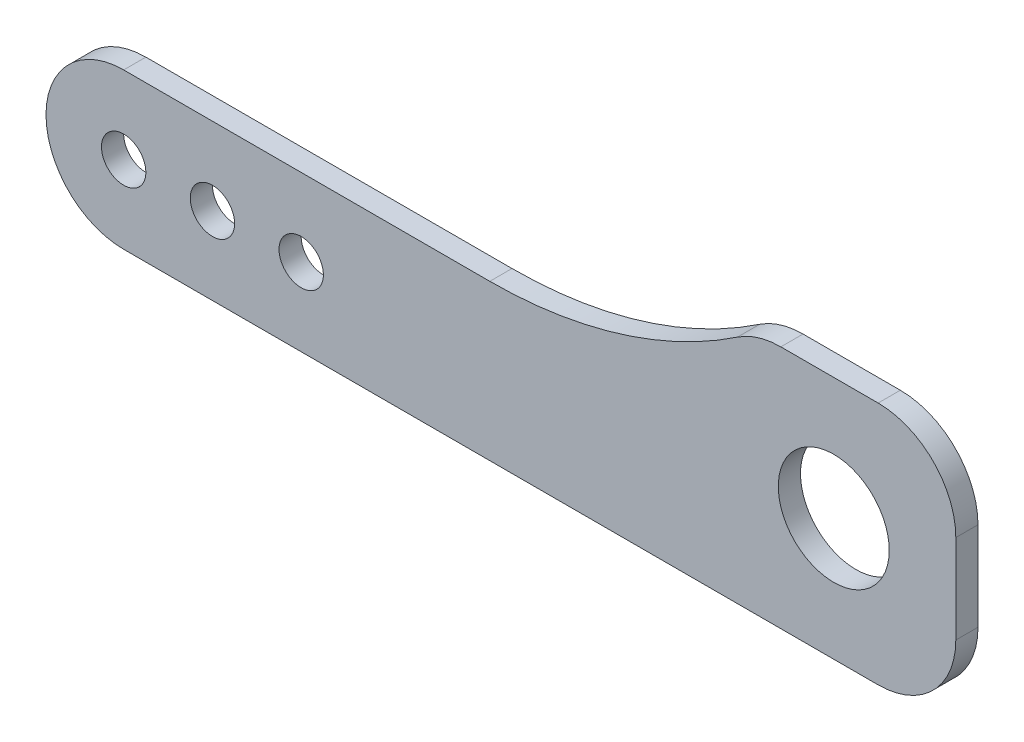
ISO-10303-21;
HEADER;
FILE_DESCRIPTION(('STEP AP214'),'2;1');
FILE_NAME('part.step','',(''),(''),'','','');
FILE_SCHEMA(('AUTOMOTIVE_DESIGN { 1 0 10303 214 1 1 1 1 }'));
ENDSEC;
DATA;
#1=APPLICATION_CONTEXT('core data for automotive mechanical design processes');
#2=APPLICATION_PROTOCOL_DEFINITION('international standard','automotive_design',2000,#1);
#3=PRODUCT_CONTEXT('',#1,'mechanical');
#4=PRODUCT('Part','Part','',(#3));
#5=PRODUCT_RELATED_PRODUCT_CATEGORY('part','',(#4));
#6=PRODUCT_DEFINITION_FORMATION('','',#4);
#7=PRODUCT_DEFINITION_CONTEXT('part definition',#1,'design');
#8=PRODUCT_DEFINITION('design','',#6,#7);
#9=PRODUCT_DEFINITION_SHAPE('','',#8);
#10=(LENGTH_UNIT() NAMED_UNIT(*) SI_UNIT(.MILLI.,.METRE.));
#11=(NAMED_UNIT(*) PLANE_ANGLE_UNIT() SI_UNIT($,.RADIAN.));
#12=(NAMED_UNIT(*) SI_UNIT($,.STERADIAN.) SOLID_ANGLE_UNIT());
#13=UNCERTAINTY_MEASURE_WITH_UNIT(LENGTH_MEASURE(1.E-05),#10,'distance_accuracy_value','');
#14=(GEOMETRIC_REPRESENTATION_CONTEXT(3) GLOBAL_UNCERTAINTY_ASSIGNED_CONTEXT((#13)) GLOBAL_UNIT_ASSIGNED_CONTEXT((#10,
#11,#12)) REPRESENTATION_CONTEXT('',''));
#15=CARTESIAN_POINT('',(0.,0.,0.));
#16=DIRECTION('',(0.,0.,1.));
#17=DIRECTION('',(1.,0.,0.));
#18=AXIS2_PLACEMENT_3D('',#15,#16,#17);
#19=CARTESIAN_POINT('',(68.,0.,2.));
#20=DIRECTION('',(0.,0.,-1.));
#21=DIRECTION('',(-1.,0.,0.));
#22=AXIS2_PLACEMENT_3D('',#19,#20,#21);
#23=CYLINDRICAL_SURFACE('',#22,7.);
#24=CARTESIAN_POINT('',(68.,0.,0.));
#25=DIRECTION('',(0.,0.,1.));
#26=DIRECTION('',(1.,0.,0.));
#27=AXIS2_PLACEMENT_3D('',#24,#25,#26);
#28=CIRCLE('',#27,7.);
#29=CARTESIAN_POINT('',(68.,-6.99999999999999,0.));
#30=VERTEX_POINT('',#29);
#31=CARTESIAN_POINT('',(75.,0.,0.));
#32=VERTEX_POINT('',#31);
#33=EDGE_CURVE('E146',#30,#32,#28,.T.);
#34=ORIENTED_EDGE('',*,*,#33,.T.);
#35=DIRECTION('',(0.,0.,-1.));
#36=VECTOR('',#35,1.);
#37=CARTESIAN_POINT('',(75.,0.,2.));
#38=LINE('',#37,#36);
#39=CARTESIAN_POINT('',(75.,0.,2.));
#40=VERTEX_POINT('',#39);
#41=EDGE_CURVE('E11',#40,#32,#38,.T.);
#42=ORIENTED_EDGE('',*,*,#41,.F.);
#43=CARTESIAN_POINT('',(68.,0.,2.));
#44=DIRECTION('',(0.,0.,1.));
#45=DIRECTION('',(1.,0.,0.));
#46=AXIS2_PLACEMENT_3D('',#43,#44,#45);
#47=CIRCLE('',#46,7.);
#48=CARTESIAN_POINT('',(68.,-6.99999999999999,2.));
#49=VERTEX_POINT('',#48);
#50=EDGE_CURVE('E172',#49,#40,#47,.T.);
#51=ORIENTED_EDGE('',*,*,#50,.F.);
#52=DIRECTION('',(0.,0.,-1.));
#53=VECTOR('',#52,1.);
#54=CARTESIAN_POINT('',(68.,-6.99999999999999,2.));
#55=LINE('',#54,#53);
#56=EDGE_CURVE('E142',#49,#30,#55,.T.);
#57=ORIENTED_EDGE('',*,*,#56,.T.);
#58=EDGE_LOOP('',(#34,#42,#51,#57));
#59=FACE_BOUND('',#58,.T.);
#60=ADVANCED_FACE('F39',(#59),#23,.T.);
#61=CARTESIAN_POINT('',(75.,0.,2.));
#62=DIRECTION('',(-1.,0.,0.));
#63=DIRECTION('',(0.,-1.,0.));
#64=AXIS2_PLACEMENT_3D('',#61,#62,#63);
#65=PLANE('',#64);
#66=DIRECTION('',(0.,1.,0.));
#67=VECTOR('',#66,1.);
#68=CARTESIAN_POINT('',(75.,0.,0.));
#69=LINE('',#68,#67);
#70=CARTESIAN_POINT('',(75.,8.00000000000001,0.));
#71=VERTEX_POINT('',#70);
#72=EDGE_CURVE('E150',#32,#71,#69,.T.);
#73=ORIENTED_EDGE('',*,*,#72,.T.);
#74=DIRECTION('',(0.,0.,-1.));
#75=VECTOR('',#74,1.);
#76=CARTESIAN_POINT('',(75.,8.00000000000001,2.));
#77=LINE('',#76,#75);
#78=CARTESIAN_POINT('',(75.,8.00000000000001,2.));
#79=VERTEX_POINT('',#78);
#80=EDGE_CURVE('E48',#79,#71,#77,.T.);
#81=ORIENTED_EDGE('',*,*,#80,.F.);
#82=DIRECTION('',(0.,1.,0.));
#83=VECTOR('',#82,1.);
#84=CARTESIAN_POINT('',(75.,0.,2.));
#85=LINE('',#84,#83);
#86=EDGE_CURVE('E102',#40,#79,#85,.T.);
#87=ORIENTED_EDGE('',*,*,#86,.F.);
#88=ORIENTED_EDGE('',*,*,#41,.T.);
#89=EDGE_LOOP('',(#73,#81,#87,#88));
#90=FACE_BOUND('',#89,.T.);
#91=ADVANCED_FACE('F285',(#90),#65,.F.);
#92=CARTESIAN_POINT('',(68.,8.00000000000001,2.));
#93=DIRECTION('',(0.,0.,-1.));
#94=DIRECTION('',(-1.,0.,0.));
#95=AXIS2_PLACEMENT_3D('',#92,#93,#94);
#96=CYLINDRICAL_SURFACE('',#95,7.);
#97=CARTESIAN_POINT('',(68.,8.00000000000001,0.));
#98=DIRECTION('',(0.,0.,1.));
#99=DIRECTION('',(-1.,0.,0.));
#100=AXIS2_PLACEMENT_3D('',#97,#98,#99);
#101=CIRCLE('',#100,7.);
#102=CARTESIAN_POINT('',(68.,15.,0.));
#103=VERTEX_POINT('',#102);
#104=EDGE_CURVE('E154',#71,#103,#101,.T.);
#105=ORIENTED_EDGE('',*,*,#104,.T.);
#106=DIRECTION('',(0.,0.,-1.));
#107=VECTOR('',#106,1.);
#108=CARTESIAN_POINT('',(68.,15.,2.));
#109=LINE('',#108,#107);
#110=CARTESIAN_POINT('',(68.,15.,2.));
#111=VERTEX_POINT('',#110);
#112=EDGE_CURVE('E187',#111,#103,#109,.T.);
#113=ORIENTED_EDGE('',*,*,#112,.F.);
#114=CARTESIAN_POINT('',(68.,8.00000000000001,2.));
#115=DIRECTION('',(0.,0.,1.));
#116=DIRECTION('',(-1.,0.,0.));
#117=AXIS2_PLACEMENT_3D('',#114,#115,#116);
#118=CIRCLE('',#117,7.);
#119=EDGE_CURVE('E197',#79,#111,#118,.T.);
#120=ORIENTED_EDGE('',*,*,#119,.F.);
#121=ORIENTED_EDGE('',*,*,#80,.T.);
#122=EDGE_LOOP('',(#105,#113,#120,#121));
#123=FACE_BOUND('',#122,.T.);
#124=ADVANCED_FACE('F195',(#123),#96,.T.);
#125=CARTESIAN_POINT('',(59.229754097208,15.,2.));
#126=DIRECTION('',(0.,-1.,0.));
#127=DIRECTION('',(0.,0.,-1.));
#128=AXIS2_PLACEMENT_3D('',#125,#126,#127);
#129=PLANE('',#128);
#130=DIRECTION('',(-1.,0.,0.));
#131=VECTOR('',#130,1.);
#132=CARTESIAN_POINT('',(59.229754097208,15.,0.));
#133=LINE('',#132,#131);
#134=CARTESIAN_POINT('',(59.229754097208,15.,0.));
#135=VERTEX_POINT('',#134);
#136=EDGE_CURVE('E157',#103,#135,#133,.T.);
#137=ORIENTED_EDGE('',*,*,#136,.T.);
#138=DIRECTION('',(0.,0.,-1.));
#139=VECTOR('',#138,1.);
#140=CARTESIAN_POINT('',(59.229754097208,15.,2.));
#141=LINE('',#140,#139);
#142=CARTESIAN_POINT('',(59.229754097208,15.,2.));
#143=VERTEX_POINT('',#142);
#144=EDGE_CURVE('E183',#143,#135,#141,.T.);
#145=ORIENTED_EDGE('',*,*,#144,.F.);
#146=DIRECTION('',(-1.,0.,0.));
#147=VECTOR('',#146,1.);
#148=CARTESIAN_POINT('',(59.229754097208,15.,2.));
#149=LINE('',#148,#147);
#150=EDGE_CURVE('E214',#111,#143,#149,.T.);
#151=ORIENTED_EDGE('',*,*,#150,.F.);
#152=ORIENTED_EDGE('',*,*,#112,.T.);
#153=EDGE_LOOP('',(#137,#145,#151,#152));
#154=FACE_BOUND('',#153,.T.);
#155=ADVANCED_FACE('F206',(#154),#129,.F.);
#156=CARTESIAN_POINT('',(59.229754097208,8.00000000000001,2.));
#157=DIRECTION('',(0.,0.,-1.));
#158=DIRECTION('',(-1.,0.,0.));
#159=AXIS2_PLACEMENT_3D('',#156,#157,#158);
#160=CYLINDRICAL_SURFACE('',#159,7.);
#161=CARTESIAN_POINT('',(59.229754097208,8.00000000000001,0.));
#162=DIRECTION('',(0.,0.,1.));
#163=DIRECTION('',(1.,0.,0.));
#164=AXIS2_PLACEMENT_3D('',#161,#162,#163);
#165=CIRCLE('',#164,7.);
#166=CARTESIAN_POINT('',(55.3231949763472,13.8085106382979,0.));
#167=VERTEX_POINT('',#166);
#168=EDGE_CURVE('E160',#135,#167,#165,.T.);
#169=ORIENTED_EDGE('',*,*,#168,.T.);
#170=DIRECTION('',(0.,0.,-1.));
#171=VECTOR('',#170,1.);
#172=CARTESIAN_POINT('',(55.3231949763472,13.8085106382979,2.));
#173=LINE('',#172,#171);
#174=CARTESIAN_POINT('',(55.3231949763472,13.8085106382979,2.));
#175=VERTEX_POINT('',#174);
#176=EDGE_CURVE('E179',#175,#167,#173,.T.);
#177=ORIENTED_EDGE('',*,*,#176,.F.);
#178=CARTESIAN_POINT('',(59.229754097208,8.00000000000001,2.));
#179=DIRECTION('',(0.,0.,1.));
#180=DIRECTION('',(1.,0.,0.));
#181=AXIS2_PLACEMENT_3D('',#178,#179,#180);
#182=CIRCLE('',#181,7.);
#183=EDGE_CURVE('E212',#143,#175,#182,.T.);
#184=ORIENTED_EDGE('',*,*,#183,.F.);
#185=ORIENTED_EDGE('',*,*,#144,.T.);
#186=EDGE_LOOP('',(#169,#177,#184,#185));
#187=FACE_BOUND('',#186,.T.);
#188=ADVANCED_FACE('F210',(#187),#160,.T.);
#189=CARTESIAN_POINT('',(33.,47.,2.));
#190=DIRECTION('',(0.,0.,-1.));
#191=DIRECTION('',(-1.,0.,0.));
#192=AXIS2_PLACEMENT_3D('',#189,#190,#191);
#193=CYLINDRICAL_SURFACE('',#192,40.);
#194=CARTESIAN_POINT('',(33.,47.,0.));
#195=DIRECTION('',(0.,0.,-1.));
#196=DIRECTION('',(1.,0.,0.));
#197=AXIS2_PLACEMENT_3D('',#194,#195,#196);
#198=CIRCLE('',#197,40.);
#199=CARTESIAN_POINT('',(33.,7.,0.));
#200=VERTEX_POINT('',#199);
#201=EDGE_CURVE('E163',#167,#200,#198,.T.);
#202=ORIENTED_EDGE('',*,*,#201,.T.);
#203=DIRECTION('',(0.,0.,-1.));
#204=VECTOR('',#203,1.);
#205=CARTESIAN_POINT('',(33.,7.,2.));
#206=LINE('',#205,#204);
#207=CARTESIAN_POINT('',(33.,7.,2.));
#208=VERTEX_POINT('',#207);
#209=EDGE_CURVE('E135',#208,#200,#206,.T.);
#210=ORIENTED_EDGE('',*,*,#209,.F.);
#211=CARTESIAN_POINT('',(33.,47.,2.));
#212=DIRECTION('',(0.,0.,-1.));
#213=DIRECTION('',(1.,0.,0.));
#214=AXIS2_PLACEMENT_3D('',#211,#212,#213);
#215=CIRCLE('',#214,40.);
#216=EDGE_CURVE('E124',#175,#208,#215,.T.);
#217=ORIENTED_EDGE('',*,*,#216,.F.);
#218=ORIENTED_EDGE('',*,*,#176,.T.);
#219=EDGE_LOOP('',(#202,#210,#217,#218));
#220=FACE_BOUND('',#219,.T.);
#221=ADVANCED_FACE('F293',(#220),#193,.F.);
#222=CARTESIAN_POINT('',(0.,7.,2.));
#223=DIRECTION('',(0.,-1.,0.));
#224=DIRECTION('',(1.,0.,0.));
#225=AXIS2_PLACEMENT_3D('',#222,#223,#224);
#226=PLANE('',#225);
#227=DIRECTION('',(-1.,0.,0.));
#228=VECTOR('',#227,1.);
#229=CARTESIAN_POINT('',(0.,7.,0.));
#230=LINE('',#229,#228);
#231=CARTESIAN_POINT('',(0.,7.,0.));
#232=VERTEX_POINT('',#231);
#233=EDGE_CURVE('E133',#200,#232,#230,.T.);
#234=ORIENTED_EDGE('',*,*,#233,.T.);
#235=DIRECTION('',(0.,0.,-1.));
#236=VECTOR('',#235,1.);
#237=CARTESIAN_POINT('',(0.,7.,2.));
#238=LINE('',#237,#236);
#239=CARTESIAN_POINT('',(0.,7.,2.));
#240=VERTEX_POINT('',#239);
#241=EDGE_CURVE('E130',#240,#232,#238,.T.);
#242=ORIENTED_EDGE('',*,*,#241,.F.);
#243=DIRECTION('',(-1.,0.,0.));
#244=VECTOR('',#243,1.);
#245=CARTESIAN_POINT('',(0.,7.,2.));
#246=LINE('',#245,#244);
#247=EDGE_CURVE('E118',#208,#240,#246,.T.);
#248=ORIENTED_EDGE('',*,*,#247,.F.);
#249=ORIENTED_EDGE('',*,*,#209,.T.);
#250=EDGE_LOOP('',(#234,#242,#248,#249));
#251=FACE_BOUND('',#250,.T.);
#252=ADVANCED_FACE('F131',(#251),#226,.F.);
#253=CARTESIAN_POINT('',(0.,0.,2.));
#254=DIRECTION('',(0.,0.,-1.));
#255=DIRECTION('',(-1.,0.,0.));
#256=AXIS2_PLACEMENT_3D('',#253,#254,#255);
#257=CYLINDRICAL_SURFACE('',#256,7.);
#258=CARTESIAN_POINT('',(0.,0.,0.));
#259=DIRECTION('',(0.,0.,1.));
#260=DIRECTION('',(-1.,0.,0.));
#261=AXIS2_PLACEMENT_3D('',#258,#259,#260);
#262=CIRCLE('',#261,7.);
#263=CARTESIAN_POINT('',(0.,-7.,0.));
#264=VERTEX_POINT('',#263);
#265=EDGE_CURVE('E88',#232,#264,#262,.T.);
#266=ORIENTED_EDGE('',*,*,#265,.T.);
#267=DIRECTION('',(0.,0.,-1.));
#268=VECTOR('',#267,1.);
#269=CARTESIAN_POINT('',(0.,-7.,2.));
#270=LINE('',#269,#268);
#271=CARTESIAN_POINT('',(0.,-7.,2.));
#272=VERTEX_POINT('',#271);
#273=EDGE_CURVE('E136',#272,#264,#270,.T.);
#274=ORIENTED_EDGE('',*,*,#273,.F.);
#275=CARTESIAN_POINT('',(0.,0.,2.));
#276=DIRECTION('',(0.,0.,1.));
#277=DIRECTION('',(-1.,0.,0.));
#278=AXIS2_PLACEMENT_3D('',#275,#276,#277);
#279=CIRCLE('',#278,7.);
#280=EDGE_CURVE('E122',#240,#272,#279,.T.);
#281=ORIENTED_EDGE('',*,*,#280,.F.);
#282=ORIENTED_EDGE('',*,*,#241,.T.);
#283=EDGE_LOOP('',(#266,#274,#281,#282));
#284=FACE_BOUND('',#283,.T.);
#285=ADVANCED_FACE('F138',(#284),#257,.T.);
#286=CARTESIAN_POINT('',(68.,-6.99999999999999,2.));
#287=DIRECTION('',(0.,1.,0.));
#288=DIRECTION('',(-1.,0.,0.));
#289=AXIS2_PLACEMENT_3D('',#286,#287,#288);
#290=PLANE('',#289);
#291=DIRECTION('',(1.,0.,0.));
#292=VECTOR('',#291,1.);
#293=CARTESIAN_POINT('',(68.,-6.99999999999999,0.));
#294=LINE('',#293,#292);
#295=EDGE_CURVE('E94',#264,#30,#294,.T.);
#296=ORIENTED_EDGE('',*,*,#295,.T.);
#297=ORIENTED_EDGE('',*,*,#56,.F.);
#298=DIRECTION('',(1.,0.,0.));
#299=VECTOR('',#298,1.);
#300=CARTESIAN_POINT('',(68.,-6.99999999999999,2.));
#301=LINE('',#300,#299);
#302=EDGE_CURVE('E56',#272,#49,#301,.T.);
#303=ORIENTED_EDGE('',*,*,#302,.F.);
#304=ORIENTED_EDGE('',*,*,#273,.T.);
#305=EDGE_LOOP('',(#296,#297,#303,#304));
#306=FACE_BOUND('',#305,.T.);
#307=ADVANCED_FACE('F262',(#306),#290,.F.);
#308=CARTESIAN_POINT('',(68.,0.,2.));
#309=DIRECTION('',(0.,0.,1.));
#310=DIRECTION('',(1.,0.,0.));
#311=AXIS2_PLACEMENT_3D('',#308,#309,#310);
#312=PLANE('',#311);
#313=CARTESIAN_POINT('',(64.,4.00000000000001,2.));
#314=DIRECTION('',(0.,0.,1.));
#315=DIRECTION('',(1.,0.,0.));
#316=AXIS2_PLACEMENT_3D('',#313,#314,#315);
#317=CIRCLE('',#316,5.);
#318=CARTESIAN_POINT('',(69.,4.00000000000001,2.));
#319=VERTEX_POINT('',#318);
#320=EDGE_CURVE('E253',#319,#319,#317,.T.);
#321=ORIENTED_EDGE('',*,*,#320,.F.);
#322=EDGE_LOOP('',(#321));
#323=FACE_BOUND('',#322,.T.);
#324=CARTESIAN_POINT('',(0.,0.,2.));
#325=DIRECTION('',(0.,0.,1.));
#326=DIRECTION('',(1.,0.,0.));
#327=AXIS2_PLACEMENT_3D('',#324,#325,#326);
#328=CIRCLE('',#327,2.);
#329=CARTESIAN_POINT('',(2.,0.,2.));
#330=VERTEX_POINT('',#329);
#331=EDGE_CURVE('E240',#330,#330,#328,.T.);
#332=ORIENTED_EDGE('',*,*,#331,.F.);
#333=EDGE_LOOP('',(#332));
#334=FACE_BOUND('',#333,.T.);
#335=CARTESIAN_POINT('',(8.,0.,2.));
#336=DIRECTION('',(0.,0.,1.));
#337=DIRECTION('',(1.,0.,0.));
#338=AXIS2_PLACEMENT_3D('',#335,#336,#337);
#339=CIRCLE('',#338,2.);
#340=CARTESIAN_POINT('',(10.,0.,2.));
#341=VERTEX_POINT('',#340);
#342=EDGE_CURVE('E230',#341,#341,#339,.T.);
#343=ORIENTED_EDGE('',*,*,#342,.F.);
#344=EDGE_LOOP('',(#343));
#345=FACE_BOUND('',#344,.T.);
#346=CARTESIAN_POINT('',(16.,0.,2.));
#347=DIRECTION('',(0.,0.,1.));
#348=DIRECTION('',(1.,0.,0.));
#349=AXIS2_PLACEMENT_3D('',#346,#347,#348);
#350=CIRCLE('',#349,2.);
#351=CARTESIAN_POINT('',(18.,0.,2.));
#352=VERTEX_POINT('',#351);
#353=EDGE_CURVE('E231',#352,#352,#350,.T.);
#354=ORIENTED_EDGE('',*,*,#353,.F.);
#355=EDGE_LOOP('',(#354));
#356=FACE_BOUND('',#355,.T.);
#357=ORIENTED_EDGE('',*,*,#50,.T.);
#358=ORIENTED_EDGE('',*,*,#86,.T.);
#359=ORIENTED_EDGE('',*,*,#119,.T.);
#360=ORIENTED_EDGE('',*,*,#150,.T.);
#361=ORIENTED_EDGE('',*,*,#183,.T.);
#362=ORIENTED_EDGE('',*,*,#216,.T.);
#363=ORIENTED_EDGE('',*,*,#247,.T.);
#364=ORIENTED_EDGE('',*,*,#280,.T.);
#365=ORIENTED_EDGE('',*,*,#302,.T.);
#366=EDGE_LOOP('',(#357,#358,#359,#360,#361,#362,#363,#364,#365));
#367=FACE_BOUND('',#366,.T.);
#368=ADVANCED_FACE('F120',(#323,#334,#345,#356,#367),#312,.T.);
#369=CARTESIAN_POINT('',(68.,0.,0.));
#370=DIRECTION('',(0.,0.,1.));
#371=DIRECTION('',(1.,0.,0.));
#372=AXIS2_PLACEMENT_3D('',#369,#370,#371);
#373=PLANE('',#372);
#374=CARTESIAN_POINT('',(64.,4.00000000000001,0.));
#375=DIRECTION('',(0.,0.,1.));
#376=DIRECTION('',(1.,0.,0.));
#377=AXIS2_PLACEMENT_3D('',#374,#375,#376);
#378=CIRCLE('',#377,5.);
#379=CARTESIAN_POINT('',(69.,4.00000000000001,0.));
#380=VERTEX_POINT('',#379);
#381=EDGE_CURVE('E235',#380,#380,#378,.F.);
#382=ORIENTED_EDGE('',*,*,#381,.F.);
#383=EDGE_LOOP('',(#382));
#384=FACE_BOUND('',#383,.T.);
#385=CARTESIAN_POINT('',(0.,0.,0.));
#386=DIRECTION('',(0.,0.,1.));
#387=DIRECTION('',(1.,0.,0.));
#388=AXIS2_PLACEMENT_3D('',#385,#386,#387);
#389=CIRCLE('',#388,2.);
#390=CARTESIAN_POINT('',(2.,0.,0.));
#391=VERTEX_POINT('',#390);
#392=EDGE_CURVE('E151',#391,#391,#389,.F.);
#393=ORIENTED_EDGE('',*,*,#392,.F.);
#394=EDGE_LOOP('',(#393));
#395=FACE_BOUND('',#394,.T.);
#396=CARTESIAN_POINT('',(8.,0.,0.));
#397=DIRECTION('',(0.,0.,1.));
#398=DIRECTION('',(1.,0.,0.));
#399=AXIS2_PLACEMENT_3D('',#396,#397,#398);
#400=CIRCLE('',#399,2.);
#401=CARTESIAN_POINT('',(10.,0.,0.));
#402=VERTEX_POINT('',#401);
#403=EDGE_CURVE('E236',#402,#402,#400,.F.);
#404=ORIENTED_EDGE('',*,*,#403,.F.);
#405=EDGE_LOOP('',(#404));
#406=FACE_BOUND('',#405,.T.);
#407=CARTESIAN_POINT('',(16.,0.,0.));
#408=DIRECTION('',(0.,0.,1.));
#409=DIRECTION('',(1.,0.,0.));
#410=AXIS2_PLACEMENT_3D('',#407,#408,#409);
#411=CIRCLE('',#410,2.);
#412=CARTESIAN_POINT('',(18.,0.,0.));
#413=VERTEX_POINT('',#412);
#414=EDGE_CURVE('E226',#413,#413,#411,.F.);
#415=ORIENTED_EDGE('',*,*,#414,.F.);
#416=EDGE_LOOP('',(#415));
#417=FACE_BOUND('',#416,.T.);
#418=ORIENTED_EDGE('',*,*,#33,.F.);
#419=ORIENTED_EDGE('',*,*,#295,.F.);
#420=ORIENTED_EDGE('',*,*,#265,.F.);
#421=ORIENTED_EDGE('',*,*,#233,.F.);
#422=ORIENTED_EDGE('',*,*,#201,.F.);
#423=ORIENTED_EDGE('',*,*,#168,.F.);
#424=ORIENTED_EDGE('',*,*,#136,.F.);
#425=ORIENTED_EDGE('',*,*,#104,.F.);
#426=ORIENTED_EDGE('',*,*,#72,.F.);
#427=EDGE_LOOP('',(#418,#419,#420,#421,#422,#423,#424,#425,#426));
#428=FACE_BOUND('',#427,.T.);
#429=ADVANCED_FACE('F201',(#384,#395,#406,#417,#428),#373,.F.);
#430=CARTESIAN_POINT('',(16.,0.,-5.65685424949239));
#431=DIRECTION('',(0.,0.,1.));
#432=DIRECTION('',(1.,0.,0.));
#433=AXIS2_PLACEMENT_3D('',#430,#431,#432);
#434=CYLINDRICAL_SURFACE('',#433,2.);
#435=ORIENTED_EDGE('',*,*,#414,.T.);
#436=EDGE_LOOP('',(#435));
#437=FACE_BOUND('',#436,.T.);
#438=ORIENTED_EDGE('',*,*,#353,.T.);
#439=EDGE_LOOP('',(#438));
#440=FACE_BOUND('',#439,.T.);
#441=ADVANCED_FACE('F270',(#437,#440),#434,.F.);
#442=CARTESIAN_POINT('',(8.,0.,-5.65685424949239));
#443=DIRECTION('',(0.,0.,1.));
#444=DIRECTION('',(1.,0.,0.));
#445=AXIS2_PLACEMENT_3D('',#442,#443,#444);
#446=CYLINDRICAL_SURFACE('',#445,2.);
#447=ORIENTED_EDGE('',*,*,#403,.T.);
#448=EDGE_LOOP('',(#447));
#449=FACE_BOUND('',#448,.T.);
#450=ORIENTED_EDGE('',*,*,#342,.T.);
#451=EDGE_LOOP('',(#450));
#452=FACE_BOUND('',#451,.T.);
#453=ADVANCED_FACE('F272',(#449,#452),#446,.F.);
#454=CARTESIAN_POINT('',(0.,0.,-5.65685424949239));
#455=DIRECTION('',(0.,0.,1.));
#456=DIRECTION('',(1.,0.,0.));
#457=AXIS2_PLACEMENT_3D('',#454,#455,#456);
#458=CYLINDRICAL_SURFACE('',#457,2.);
#459=ORIENTED_EDGE('',*,*,#392,.T.);
#460=EDGE_LOOP('',(#459));
#461=FACE_BOUND('',#460,.T.);
#462=ORIENTED_EDGE('',*,*,#331,.T.);
#463=EDGE_LOOP('',(#462));
#464=FACE_BOUND('',#463,.T.);
#465=ADVANCED_FACE('F279',(#461,#464),#458,.F.);
#466=CARTESIAN_POINT('',(64.,4.00000000000001,-14.142135623731));
#467=DIRECTION('',(0.,0.,1.));
#468=DIRECTION('',(1.,0.,0.));
#469=AXIS2_PLACEMENT_3D('',#466,#467,#468);
#470=CYLINDRICAL_SURFACE('',#469,5.);
#471=ORIENTED_EDGE('',*,*,#381,.T.);
#472=EDGE_LOOP('',(#471));
#473=FACE_BOUND('',#472,.T.);
#474=ORIENTED_EDGE('',*,*,#320,.T.);
#475=EDGE_LOOP('',(#474));
#476=FACE_BOUND('',#475,.T.);
#477=ADVANCED_FACE('F258',(#473,#476),#470,.F.);
#478=CLOSED_SHELL('',(#60,#91,#124,#155,#188,#221,#252,#285,#307,#368,#429,#441,#453,#465,#477));
#479=MANIFOLD_SOLID_BREP('B2',#478);
#480=ADVANCED_BREP_SHAPE_REPRESENTATION('',(#18,#479),#14);
#481=SHAPE_DEFINITION_REPRESENTATION(#9,#480);
ENDSEC;
END-ISO-10303-21;
